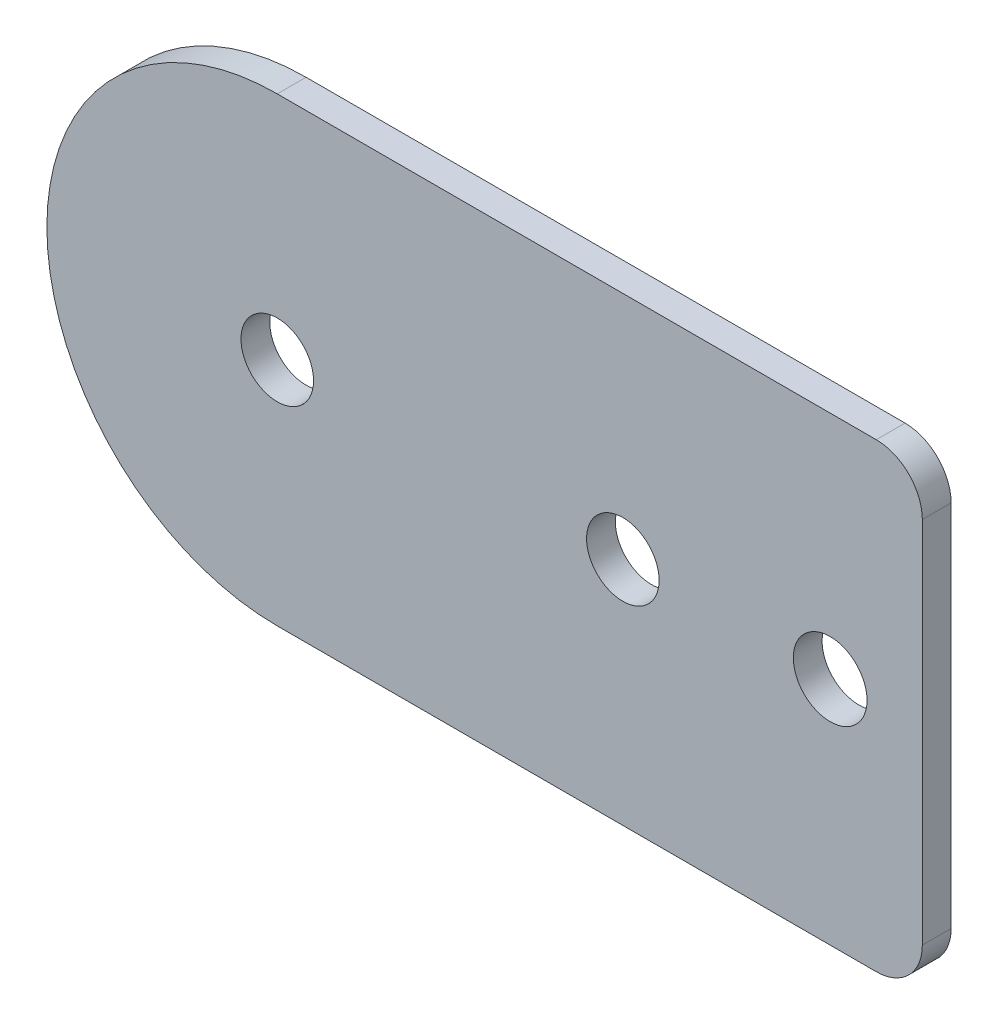
ISO-10303-21;
HEADER;
FILE_DESCRIPTION(('STEP AP214'),'2;1');
FILE_NAME('part.step','',(''),(''),'','','');
FILE_SCHEMA(('AUTOMOTIVE_DESIGN { 1 0 10303 214 1 1 1 1 }'));
ENDSEC;
DATA;
#1=APPLICATION_CONTEXT('core data for automotive mechanical design processes');
#2=APPLICATION_PROTOCOL_DEFINITION('international standard','automotive_design',2000,#1);
#3=PRODUCT_CONTEXT('',#1,'mechanical');
#4=PRODUCT('Part','Part','',(#3));
#5=PRODUCT_RELATED_PRODUCT_CATEGORY('part','',(#4));
#6=PRODUCT_DEFINITION_FORMATION('','',#4);
#7=PRODUCT_DEFINITION_CONTEXT('part definition',#1,'design');
#8=PRODUCT_DEFINITION('design','',#6,#7);
#9=PRODUCT_DEFINITION_SHAPE('','',#8);
#10=(LENGTH_UNIT() NAMED_UNIT(*) SI_UNIT(.MILLI.,.METRE.));
#11=(NAMED_UNIT(*) PLANE_ANGLE_UNIT() SI_UNIT($,.RADIAN.));
#12=(NAMED_UNIT(*) SI_UNIT($,.STERADIAN.) SOLID_ANGLE_UNIT());
#13=UNCERTAINTY_MEASURE_WITH_UNIT(LENGTH_MEASURE(1.E-05),#10,'distance_accuracy_value','');
#14=(GEOMETRIC_REPRESENTATION_CONTEXT(3) GLOBAL_UNCERTAINTY_ASSIGNED_CONTEXT((#13)) GLOBAL_UNIT_ASSIGNED_CONTEXT((#10,
#11,#12)) REPRESENTATION_CONTEXT('',''));
#15=CARTESIAN_POINT('',(0.,0.,0.));
#16=DIRECTION('',(0.,0.,1.));
#17=DIRECTION('',(1.,0.,0.));
#18=AXIS2_PLACEMENT_3D('',#15,#16,#17);
#19=CARTESIAN_POINT('',(0.,0.,1.5875));
#20=DIRECTION('',(0.,0.,1.));
#21=DIRECTION('',(1.,0.,0.));
#22=AXIS2_PLACEMENT_3D('',#19,#20,#21);
#23=PLANE('',#22);
#24=CARTESIAN_POINT('',(19.05,0.,1.5875));
#25=DIRECTION('',(0.,0.,1.));
#26=DIRECTION('',(1.,0.,0.));
#27=AXIS2_PLACEMENT_3D('',#24,#25,#26);
#28=CIRCLE('',#27,2.);
#29=CARTESIAN_POINT('',(21.05,0.,1.5875));
#30=VERTEX_POINT('',#29);
#31=EDGE_CURVE('E252',#30,#30,#28,.T.);
#32=ORIENTED_EDGE('',*,*,#31,.F.);
#33=EDGE_LOOP('',(#32));
#34=FACE_BOUND('',#33,.T.);
#35=DIRECTION('',(1.,0.,0.));
#36=VECTOR('',#35,1.);
#37=CARTESIAN_POINT('',(0.,-12.7,1.5875));
#38=LINE('',#37,#36);
#39=CARTESIAN_POINT('',(0.,-12.7,1.5875));
#40=VERTEX_POINT('',#39);
#41=CARTESIAN_POINT('',(33.02,-12.7,1.5875));
#42=VERTEX_POINT('',#41);
#43=EDGE_CURVE('E85',#40,#42,#38,.T.);
#44=ORIENTED_EDGE('',*,*,#43,.T.);
#45=CARTESIAN_POINT('',(33.02,-10.16,1.5875));
#46=DIRECTION('',(0.,0.,1.));
#47=DIRECTION('',(1.,0.,0.));
#48=AXIS2_PLACEMENT_3D('',#45,#46,#47);
#49=CIRCLE('',#48,2.54);
#50=CARTESIAN_POINT('',(35.56,-10.16,1.5875));
#51=VERTEX_POINT('',#50);
#52=EDGE_CURVE('E40',#42,#51,#49,.T.);
#53=ORIENTED_EDGE('',*,*,#52,.T.);
#54=DIRECTION('',(0.,1.,0.));
#55=VECTOR('',#54,1.);
#56=CARTESIAN_POINT('',(35.56,-12.7,1.5875));
#57=LINE('',#56,#55);
#58=CARTESIAN_POINT('',(35.56,10.16,1.5875));
#59=VERTEX_POINT('',#58);
#60=EDGE_CURVE('E92',#51,#59,#57,.T.);
#61=ORIENTED_EDGE('',*,*,#60,.T.);
#62=CARTESIAN_POINT('',(33.02,10.16,1.5875));
#63=DIRECTION('',(0.,0.,1.));
#64=DIRECTION('',(1.,0.,0.));
#65=AXIS2_PLACEMENT_3D('',#62,#63,#64);
#66=CIRCLE('',#65,2.54);
#67=CARTESIAN_POINT('',(33.02,12.7,1.5875));
#68=VERTEX_POINT('',#67);
#69=EDGE_CURVE('E47',#59,#68,#66,.T.);
#70=ORIENTED_EDGE('',*,*,#69,.T.);
#71=DIRECTION('',(-1.,0.,0.));
#72=VECTOR('',#71,1.);
#73=CARTESIAN_POINT('',(0.,12.7,1.5875));
#74=LINE('',#73,#72);
#75=CARTESIAN_POINT('',(0.,12.7,1.5875));
#76=VERTEX_POINT('',#75);
#77=EDGE_CURVE('E97',#68,#76,#74,.T.);
#78=ORIENTED_EDGE('',*,*,#77,.T.);
#79=CARTESIAN_POINT('',(0.,0.,1.5875));
#80=DIRECTION('',(0.,0.,1.));
#81=DIRECTION('',(1.,0.,0.));
#82=AXIS2_PLACEMENT_3D('',#79,#80,#81);
#83=CIRCLE('',#82,12.7);
#84=EDGE_CURVE('E93',#76,#40,#83,.T.);
#85=ORIENTED_EDGE('',*,*,#84,.T.);
#86=EDGE_LOOP('',(#44,#53,#61,#70,#78,#85));
#87=FACE_BOUND('',#86,.T.);
#88=CARTESIAN_POINT('',(0.,0.,1.5875));
#89=DIRECTION('',(0.,0.,1.));
#90=DIRECTION('',(1.,0.,0.));
#91=AXIS2_PLACEMENT_3D('',#88,#89,#90);
#92=CIRCLE('',#91,2.);
#93=CARTESIAN_POINT('',(2.,0.,1.5875));
#94=VERTEX_POINT('',#93);
#95=EDGE_CURVE('E138',#94,#94,#92,.T.);
#96=ORIENTED_EDGE('',*,*,#95,.F.);
#97=EDGE_LOOP('',(#96));
#98=FACE_BOUND('',#97,.T.);
#99=CARTESIAN_POINT('',(30.48,0.,1.5875));
#100=DIRECTION('',(0.,0.,1.));
#101=DIRECTION('',(1.,0.,0.));
#102=AXIS2_PLACEMENT_3D('',#99,#100,#101);
#103=CIRCLE('',#102,2.032);
#104=CARTESIAN_POINT('',(32.512,0.,1.5875));
#105=VERTEX_POINT('',#104);
#106=EDGE_CURVE('E243',#105,#105,#103,.T.);
#107=ORIENTED_EDGE('',*,*,#106,.F.);
#108=EDGE_LOOP('',(#107));
#109=FACE_BOUND('',#108,.T.);
#110=ADVANCED_FACE('F32',(#34,#87,#98,#109),#23,.T.);
#111=CARTESIAN_POINT('',(0.,0.,0.));
#112=DIRECTION('',(0.,0.,1.));
#113=DIRECTION('',(1.,0.,0.));
#114=AXIS2_PLACEMENT_3D('',#111,#112,#113);
#115=PLANE('',#114);
#116=DIRECTION('',(0.,1.,0.));
#117=VECTOR('',#116,1.);
#118=CARTESIAN_POINT('',(35.56,-12.7,0.));
#119=LINE('',#118,#117);
#120=CARTESIAN_POINT('',(35.56,-10.16,0.));
#121=VERTEX_POINT('',#120);
#122=CARTESIAN_POINT('',(35.56,10.16,0.));
#123=VERTEX_POINT('',#122);
#124=EDGE_CURVE('E135',#121,#123,#119,.T.);
#125=ORIENTED_EDGE('',*,*,#124,.F.);
#126=CARTESIAN_POINT('',(33.02,-10.16,0.));
#127=DIRECTION('',(0.,0.,1.));
#128=DIRECTION('',(1.,0.,0.));
#129=AXIS2_PLACEMENT_3D('',#126,#127,#128);
#130=CIRCLE('',#129,2.54);
#131=CARTESIAN_POINT('',(33.02,-12.7,0.));
#132=VERTEX_POINT('',#131);
#133=EDGE_CURVE('E118',#121,#132,#130,.F.);
#134=ORIENTED_EDGE('',*,*,#133,.T.);
#135=DIRECTION('',(1.,0.,0.));
#136=VECTOR('',#135,1.);
#137=CARTESIAN_POINT('',(0.,-12.7,0.));
#138=LINE('',#137,#136);
#139=CARTESIAN_POINT('',(0.,-12.7,0.));
#140=VERTEX_POINT('',#139);
#141=EDGE_CURVE('E134',#140,#132,#138,.T.);
#142=ORIENTED_EDGE('',*,*,#141,.F.);
#143=CARTESIAN_POINT('',(0.,0.,0.));
#144=DIRECTION('',(0.,0.,1.));
#145=DIRECTION('',(1.,0.,0.));
#146=AXIS2_PLACEMENT_3D('',#143,#144,#145);
#147=CIRCLE('',#146,12.7);
#148=CARTESIAN_POINT('',(0.,12.7,0.));
#149=VERTEX_POINT('',#148);
#150=EDGE_CURVE('E105',#149,#140,#147,.T.);
#151=ORIENTED_EDGE('',*,*,#150,.F.);
#152=DIRECTION('',(-1.,0.,0.));
#153=VECTOR('',#152,1.);
#154=CARTESIAN_POINT('',(0.,12.7,0.));
#155=LINE('',#154,#153);
#156=CARTESIAN_POINT('',(33.02,12.7,0.));
#157=VERTEX_POINT('',#156);
#158=EDGE_CURVE('E101',#157,#149,#155,.T.);
#159=ORIENTED_EDGE('',*,*,#158,.F.);
#160=CARTESIAN_POINT('',(33.02,10.16,0.));
#161=DIRECTION('',(0.,0.,1.));
#162=DIRECTION('',(1.,0.,0.));
#163=AXIS2_PLACEMENT_3D('',#160,#161,#162);
#164=CIRCLE('',#163,2.54);
#165=EDGE_CURVE('E116',#157,#123,#164,.F.);
#166=ORIENTED_EDGE('',*,*,#165,.T.);
#167=EDGE_LOOP('',(#125,#134,#142,#151,#159,#166));
#168=FACE_BOUND('',#167,.T.);
#169=CARTESIAN_POINT('',(0.,0.,0.));
#170=DIRECTION('',(0.,0.,1.));
#171=DIRECTION('',(1.,0.,0.));
#172=AXIS2_PLACEMENT_3D('',#169,#170,#171);
#173=CIRCLE('',#172,2.);
#174=CARTESIAN_POINT('',(2.,0.,0.));
#175=VERTEX_POINT('',#174);
#176=EDGE_CURVE('E255',#175,#175,#173,.T.);
#177=ORIENTED_EDGE('',*,*,#176,.T.);
#178=EDGE_LOOP('',(#177));
#179=FACE_BOUND('',#178,.T.);
#180=CARTESIAN_POINT('',(19.05,0.,0.));
#181=DIRECTION('',(0.,0.,1.));
#182=DIRECTION('',(1.,0.,0.));
#183=AXIS2_PLACEMENT_3D('',#180,#181,#182);
#184=CIRCLE('',#183,2.);
#185=CARTESIAN_POINT('',(21.05,0.,0.));
#186=VERTEX_POINT('',#185);
#187=EDGE_CURVE('E249',#186,#186,#184,.T.);
#188=ORIENTED_EDGE('',*,*,#187,.T.);
#189=EDGE_LOOP('',(#188));
#190=FACE_BOUND('',#189,.T.);
#191=CARTESIAN_POINT('',(30.48,0.,0.));
#192=DIRECTION('',(0.,0.,1.));
#193=DIRECTION('',(1.,0.,0.));
#194=AXIS2_PLACEMENT_3D('',#191,#192,#193);
#195=CIRCLE('',#194,2.032);
#196=CARTESIAN_POINT('',(32.512,0.,0.));
#197=VERTEX_POINT('',#196);
#198=EDGE_CURVE('E246',#197,#197,#195,.T.);
#199=ORIENTED_EDGE('',*,*,#198,.T.);
#200=EDGE_LOOP('',(#199));
#201=FACE_BOUND('',#200,.T.);
#202=ADVANCED_FACE('F132',(#168,#179,#190,#201),#115,.F.);
#203=CARTESIAN_POINT('',(0.,0.,1.5875));
#204=DIRECTION('',(0.,0.,-1.));
#205=DIRECTION('',(-1.,0.,0.));
#206=AXIS2_PLACEMENT_3D('',#203,#204,#205);
#207=CYLINDRICAL_SURFACE('',#206,12.7);
#208=ORIENTED_EDGE('',*,*,#150,.T.);
#209=DIRECTION('',(0.,0.,-1.));
#210=VECTOR('',#209,1.);
#211=CARTESIAN_POINT('',(0.,-12.7,1.5875));
#212=LINE('',#211,#210);
#213=EDGE_CURVE('E89',#40,#140,#212,.T.);
#214=ORIENTED_EDGE('',*,*,#213,.F.);
#215=ORIENTED_EDGE('',*,*,#84,.F.);
#216=DIRECTION('',(0.,0.,-1.));
#217=VECTOR('',#216,1.);
#218=CARTESIAN_POINT('',(0.,12.7,1.5875));
#219=LINE('',#218,#217);
#220=EDGE_CURVE('E107',#76,#149,#219,.T.);
#221=ORIENTED_EDGE('',*,*,#220,.T.);
#222=EDGE_LOOP('',(#208,#214,#215,#221));
#223=FACE_BOUND('',#222,.T.);
#224=ADVANCED_FACE('F103',(#223),#207,.T.);
#225=CARTESIAN_POINT('',(0.,-12.7,1.5875));
#226=DIRECTION('',(0.,1.,0.));
#227=DIRECTION('',(0.,0.,1.));
#228=AXIS2_PLACEMENT_3D('',#225,#226,#227);
#229=PLANE('',#228);
#230=ORIENTED_EDGE('',*,*,#141,.T.);
#231=DIRECTION('',(0.,0.,-1.));
#232=VECTOR('',#231,1.);
#233=CARTESIAN_POINT('',(33.02,-12.7,1.5875));
#234=LINE('',#233,#232);
#235=EDGE_CURVE('E55',#132,#42,#234,.F.);
#236=ORIENTED_EDGE('',*,*,#235,.T.);
#237=ORIENTED_EDGE('',*,*,#43,.F.);
#238=ORIENTED_EDGE('',*,*,#213,.T.);
#239=EDGE_LOOP('',(#230,#236,#237,#238));
#240=FACE_BOUND('',#239,.T.);
#241=ADVANCED_FACE('F87',(#240),#229,.F.);
#242=CARTESIAN_POINT('',(35.56,-12.7,1.5875));
#243=DIRECTION('',(-1.,0.,0.));
#244=DIRECTION('',(0.,0.,1.));
#245=AXIS2_PLACEMENT_3D('',#242,#243,#244);
#246=PLANE('',#245);
#247=ORIENTED_EDGE('',*,*,#60,.F.);
#248=DIRECTION('',(0.,0.,-1.));
#249=VECTOR('',#248,1.);
#250=CARTESIAN_POINT('',(35.56,-10.16,1.5875));
#251=LINE('',#250,#249);
#252=EDGE_CURVE('E109',#51,#121,#251,.T.);
#253=ORIENTED_EDGE('',*,*,#252,.T.);
#254=ORIENTED_EDGE('',*,*,#124,.T.);
#255=DIRECTION('',(0.,0.,-1.));
#256=VECTOR('',#255,1.);
#257=CARTESIAN_POINT('',(35.56,10.16,1.5875));
#258=LINE('',#257,#256);
#259=EDGE_CURVE('E106',#123,#59,#258,.F.);
#260=ORIENTED_EDGE('',*,*,#259,.T.);
#261=EDGE_LOOP('',(#247,#253,#254,#260));
#262=FACE_BOUND('',#261,.T.);
#263=ADVANCED_FACE('F125',(#262),#246,.F.);
#264=CARTESIAN_POINT('',(0.,12.7,1.5875));
#265=DIRECTION('',(0.,-1.,0.));
#266=DIRECTION('',(0.,0.,-1.));
#267=AXIS2_PLACEMENT_3D('',#264,#265,#266);
#268=PLANE('',#267);
#269=ORIENTED_EDGE('',*,*,#77,.F.);
#270=DIRECTION('',(0.,0.,-1.));
#271=VECTOR('',#270,1.);
#272=CARTESIAN_POINT('',(33.02,12.7,1.5875));
#273=LINE('',#272,#271);
#274=EDGE_CURVE('E11',#68,#157,#273,.T.);
#275=ORIENTED_EDGE('',*,*,#274,.T.);
#276=ORIENTED_EDGE('',*,*,#158,.T.);
#277=ORIENTED_EDGE('',*,*,#220,.F.);
#278=EDGE_LOOP('',(#269,#275,#276,#277));
#279=FACE_BOUND('',#278,.T.);
#280=ADVANCED_FACE('F143',(#279),#268,.F.);
#281=CARTESIAN_POINT('',(0.,0.,1.5875));
#282=DIRECTION('',(0.,0.,-1.));
#283=DIRECTION('',(-1.,0.,0.));
#284=AXIS2_PLACEMENT_3D('',#281,#282,#283);
#285=CYLINDRICAL_SURFACE('',#284,2.);
#286=ORIENTED_EDGE('',*,*,#95,.T.);
#287=EDGE_LOOP('',(#286));
#288=FACE_BOUND('',#287,.T.);
#289=ORIENTED_EDGE('',*,*,#176,.F.);
#290=EDGE_LOOP('',(#289));
#291=FACE_BOUND('',#290,.T.);
#292=ADVANCED_FACE('F160',(#288,#291),#285,.F.);
#293=CARTESIAN_POINT('',(19.05,0.,1.5875));
#294=DIRECTION('',(0.,0.,-1.));
#295=DIRECTION('',(-1.,0.,0.));
#296=AXIS2_PLACEMENT_3D('',#293,#294,#295);
#297=CYLINDRICAL_SURFACE('',#296,2.);
#298=ORIENTED_EDGE('',*,*,#31,.T.);
#299=EDGE_LOOP('',(#298));
#300=FACE_BOUND('',#299,.T.);
#301=ORIENTED_EDGE('',*,*,#187,.F.);
#302=EDGE_LOOP('',(#301));
#303=FACE_BOUND('',#302,.T.);
#304=ADVANCED_FACE('F193',(#300,#303),#297,.F.);
#305=CARTESIAN_POINT('',(30.48,0.,1.5875));
#306=DIRECTION('',(0.,0.,-1.));
#307=DIRECTION('',(-1.,0.,0.));
#308=AXIS2_PLACEMENT_3D('',#305,#306,#307);
#309=CYLINDRICAL_SURFACE('',#308,2.032);
#310=ORIENTED_EDGE('',*,*,#106,.T.);
#311=EDGE_LOOP('',(#310));
#312=FACE_BOUND('',#311,.T.);
#313=ORIENTED_EDGE('',*,*,#198,.F.);
#314=EDGE_LOOP('',(#313));
#315=FACE_BOUND('',#314,.T.);
#316=ADVANCED_FACE('F150',(#312,#315),#309,.F.);
#317=CARTESIAN_POINT('',(33.02,-10.16,1.5875));
#318=DIRECTION('',(0.,0.,-1.));
#319=DIRECTION('',(-1.,0.,0.));
#320=AXIS2_PLACEMENT_3D('',#317,#318,#319);
#321=CYLINDRICAL_SURFACE('',#320,2.54);
#322=ORIENTED_EDGE('',*,*,#52,.F.);
#323=ORIENTED_EDGE('',*,*,#235,.F.);
#324=ORIENTED_EDGE('',*,*,#133,.F.);
#325=ORIENTED_EDGE('',*,*,#252,.F.);
#326=EDGE_LOOP('',(#322,#323,#324,#325));
#327=FACE_BOUND('',#326,.T.);
#328=ADVANCED_FACE('F130',(#327),#321,.T.);
#329=CARTESIAN_POINT('',(33.02,10.16,1.5875));
#330=DIRECTION('',(0.,0.,-1.));
#331=DIRECTION('',(-1.,0.,0.));
#332=AXIS2_PLACEMENT_3D('',#329,#330,#331);
#333=CYLINDRICAL_SURFACE('',#332,2.54);
#334=ORIENTED_EDGE('',*,*,#69,.F.);
#335=ORIENTED_EDGE('',*,*,#259,.F.);
#336=ORIENTED_EDGE('',*,*,#165,.F.);
#337=ORIENTED_EDGE('',*,*,#274,.F.);
#338=EDGE_LOOP('',(#334,#335,#336,#337));
#339=FACE_BOUND('',#338,.T.);
#340=ADVANCED_FACE('F34',(#339),#333,.T.);
#341=CLOSED_SHELL('',(#110,#202,#224,#241,#263,#280,#292,#304,#316,#328,#340));
#342=MANIFOLD_SOLID_BREP('B2',#341);
#343=ADVANCED_BREP_SHAPE_REPRESENTATION('',(#18,#342),#14);
#344=SHAPE_DEFINITION_REPRESENTATION(#9,#343);
ENDSEC;
END-ISO-10303-21;
